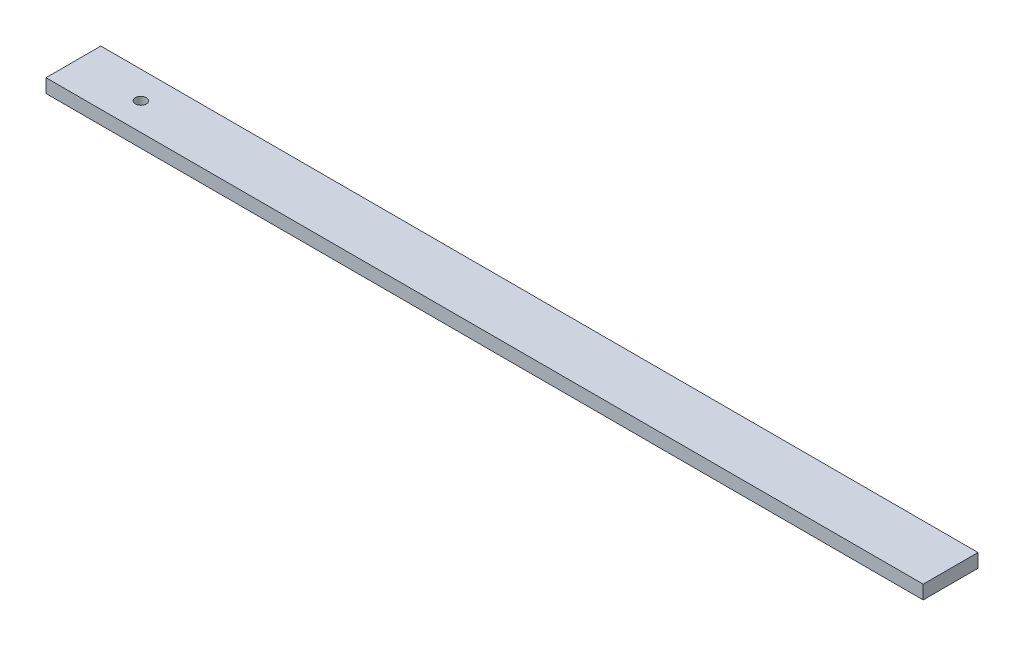
ISO-10303-21;
HEADER;
FILE_DESCRIPTION(('STEP AP214'),'2;1');
FILE_NAME('part.step','',(''),(''),'','','');
FILE_SCHEMA(('AUTOMOTIVE_DESIGN { 1 0 10303 214 1 1 1 1 }'));
ENDSEC;
DATA;
#1=APPLICATION_CONTEXT('core data for automotive mechanical design processes');
#2=APPLICATION_PROTOCOL_DEFINITION('international standard','automotive_design',2000,#1);
#3=PRODUCT_CONTEXT('',#1,'mechanical');
#4=PRODUCT('Part','Part','',(#3));
#5=PRODUCT_RELATED_PRODUCT_CATEGORY('part','',(#4));
#6=PRODUCT_DEFINITION_FORMATION('','',#4);
#7=PRODUCT_DEFINITION_CONTEXT('part definition',#1,'design');
#8=PRODUCT_DEFINITION('design','',#6,#7);
#9=PRODUCT_DEFINITION_SHAPE('','',#8);
#10=(LENGTH_UNIT() NAMED_UNIT(*) SI_UNIT(.MILLI.,.METRE.));
#11=(NAMED_UNIT(*) PLANE_ANGLE_UNIT() SI_UNIT($,.RADIAN.));
#12=(NAMED_UNIT(*) SI_UNIT($,.STERADIAN.) SOLID_ANGLE_UNIT());
#13=UNCERTAINTY_MEASURE_WITH_UNIT(LENGTH_MEASURE(1.E-05),#10,'distance_accuracy_value','');
#14=(GEOMETRIC_REPRESENTATION_CONTEXT(3) GLOBAL_UNCERTAINTY_ASSIGNED_CONTEXT((#13)) GLOBAL_UNIT_ASSIGNED_CONTEXT((#10,
#11,#12)) REPRESENTATION_CONTEXT('',''));
#15=CARTESIAN_POINT('',(0.,0.,0.));
#16=DIRECTION('',(0.,0.,1.));
#17=DIRECTION('',(1.,0.,0.));
#18=AXIS2_PLACEMENT_3D('',#15,#16,#17);
#19=CARTESIAN_POINT('',(211.2,-3.05,12.2));
#20=DIRECTION('',(0.,0.,-1.));
#21=DIRECTION('',(-1.,0.,0.));
#22=AXIS2_PLACEMENT_3D('',#19,#20,#21);
#23=PLANE('',#22);
#24=DIRECTION('',(0.,-1.,0.));
#25=VECTOR('',#24,1.);
#26=CARTESIAN_POINT('',(-195.2,-3.05,12.2));
#27=LINE('',#26,#25);
#28=CARTESIAN_POINT('',(-195.2,3.3,12.2));
#29=VERTEX_POINT('',#28);
#30=CARTESIAN_POINT('',(-195.2,-3.05,12.2));
#31=VERTEX_POINT('',#30);
#32=EDGE_CURVE('E99',#29,#31,#27,.T.);
#33=ORIENTED_EDGE('',*,*,#32,.T.);
#34=DIRECTION('',(-1.,0.,0.));
#35=VECTOR('',#34,1.);
#36=CARTESIAN_POINT('',(211.2,-3.05,12.2));
#37=LINE('',#36,#35);
#38=CARTESIAN_POINT('',(211.2,-3.05,12.2));
#39=VERTEX_POINT('',#38);
#40=EDGE_CURVE('E11',#39,#31,#37,.T.);
#41=ORIENTED_EDGE('',*,*,#40,.F.);
#42=DIRECTION('',(0.,-1.,0.));
#43=VECTOR('',#42,1.);
#44=CARTESIAN_POINT('',(211.2,-3.05,12.2));
#45=LINE('',#44,#43);
#46=CARTESIAN_POINT('',(211.2,3.3,12.2));
#47=VERTEX_POINT('',#46);
#48=EDGE_CURVE('E87',#47,#39,#45,.T.);
#49=ORIENTED_EDGE('',*,*,#48,.F.);
#50=DIRECTION('',(-1.,0.,0.));
#51=VECTOR('',#50,1.);
#52=CARTESIAN_POINT('',(211.2,3.3,12.2));
#53=LINE('',#52,#51);
#54=EDGE_CURVE('E95',#47,#29,#53,.T.);
#55=ORIENTED_EDGE('',*,*,#54,.T.);
#56=EDGE_LOOP('',(#33,#41,#49,#55));
#57=FACE_BOUND('',#56,.T.);
#58=ADVANCED_FACE('F36',(#57),#23,.F.);
#59=CARTESIAN_POINT('',(211.2,-3.05,12.2));
#60=DIRECTION('',(0.,1.,0.));
#61=DIRECTION('',(0.,0.,1.));
#62=AXIS2_PLACEMENT_3D('',#59,#60,#61);
#63=PLANE('',#62);
#64=CARTESIAN_POINT('',(-163.958,-3.05,-0.5));
#65=DIRECTION('',(0.,1.,0.));
#66=DIRECTION('',(0.,0.,1.));
#67=AXIS2_PLACEMENT_3D('',#64,#65,#66);
#68=CIRCLE('',#67,2.53999999999998);
#69=CARTESIAN_POINT('',(-163.958,-3.05,2.03999999999998));
#70=VERTEX_POINT('',#69);
#71=EDGE_CURVE('E102',#70,#70,#68,.T.);
#72=ORIENTED_EDGE('',*,*,#71,.T.);
#73=EDGE_LOOP('',(#72));
#74=FACE_BOUND('',#73,.T.);
#75=DIRECTION('',(0.,0.,-1.));
#76=VECTOR('',#75,1.);
#77=CARTESIAN_POINT('',(-195.2,-3.05,12.2));
#78=LINE('',#77,#76);
#79=CARTESIAN_POINT('',(-195.2,-3.05,-13.2));
#80=VERTEX_POINT('',#79);
#81=EDGE_CURVE('E91',#31,#80,#78,.T.);
#82=ORIENTED_EDGE('',*,*,#81,.T.);
#83=DIRECTION('',(-1.,0.,0.));
#84=VECTOR('',#83,1.);
#85=CARTESIAN_POINT('',(211.2,-3.05,-13.2));
#86=LINE('',#85,#84);
#87=CARTESIAN_POINT('',(211.2,-3.05,-13.2));
#88=VERTEX_POINT('',#87);
#89=EDGE_CURVE('E44',#88,#80,#86,.T.);
#90=ORIENTED_EDGE('',*,*,#89,.F.);
#91=DIRECTION('',(0.,0.,-1.));
#92=VECTOR('',#91,1.);
#93=CARTESIAN_POINT('',(211.2,-3.05,12.2));
#94=LINE('',#93,#92);
#95=EDGE_CURVE('E82',#39,#88,#94,.T.);
#96=ORIENTED_EDGE('',*,*,#95,.F.);
#97=ORIENTED_EDGE('',*,*,#40,.T.);
#98=EDGE_LOOP('',(#82,#90,#96,#97));
#99=FACE_BOUND('',#98,.T.);
#100=ADVANCED_FACE('F90',(#74,#99),#63,.F.);
#101=CARTESIAN_POINT('',(211.2,-3.05,-13.2));
#102=DIRECTION('',(0.,0.,1.));
#103=DIRECTION('',(1.,0.,0.));
#104=AXIS2_PLACEMENT_3D('',#101,#102,#103);
#105=PLANE('',#104);
#106=DIRECTION('',(0.,1.,0.));
#107=VECTOR('',#106,1.);
#108=CARTESIAN_POINT('',(-195.2,-3.05,-13.2));
#109=LINE('',#108,#107);
#110=CARTESIAN_POINT('',(-195.2,3.3,-13.2));
#111=VERTEX_POINT('',#110);
#112=EDGE_CURVE('E69',#80,#111,#109,.T.);
#113=ORIENTED_EDGE('',*,*,#112,.T.);
#114=DIRECTION('',(-1.,0.,0.));
#115=VECTOR('',#114,1.);
#116=CARTESIAN_POINT('',(211.2,3.3,-13.2));
#117=LINE('',#116,#115);
#118=CARTESIAN_POINT('',(211.2,3.3,-13.2));
#119=VERTEX_POINT('',#118);
#120=EDGE_CURVE('E92',#119,#111,#117,.T.);
#121=ORIENTED_EDGE('',*,*,#120,.F.);
#122=DIRECTION('',(0.,1.,0.));
#123=VECTOR('',#122,1.);
#124=CARTESIAN_POINT('',(211.2,-3.05,-13.2));
#125=LINE('',#124,#123);
#126=EDGE_CURVE('E85',#88,#119,#125,.T.);
#127=ORIENTED_EDGE('',*,*,#126,.F.);
#128=ORIENTED_EDGE('',*,*,#89,.T.);
#129=EDGE_LOOP('',(#113,#121,#127,#128));
#130=FACE_BOUND('',#129,.T.);
#131=ADVANCED_FACE('F93',(#130),#105,.F.);
#132=CARTESIAN_POINT('',(211.2,3.3,12.2));
#133=DIRECTION('',(0.,-1.,0.));
#134=DIRECTION('',(0.,0.,-1.));
#135=AXIS2_PLACEMENT_3D('',#132,#133,#134);
#136=PLANE('',#135);
#137=CARTESIAN_POINT('',(-163.958,3.3,-0.5));
#138=DIRECTION('',(0.,1.,0.));
#139=DIRECTION('',(0.,0.,1.));
#140=AXIS2_PLACEMENT_3D('',#137,#138,#139);
#141=CIRCLE('',#140,2.53999999999998);
#142=CARTESIAN_POINT('',(-163.958,3.3,2.03999999999998));
#143=VERTEX_POINT('',#142);
#144=EDGE_CURVE('E113',#143,#143,#141,.T.);
#145=ORIENTED_EDGE('',*,*,#144,.F.);
#146=EDGE_LOOP('',(#145));
#147=FACE_BOUND('',#146,.T.);
#148=DIRECTION('',(0.,0.,1.));
#149=VECTOR('',#148,1.);
#150=CARTESIAN_POINT('',(-195.2,3.3,12.2));
#151=LINE('',#150,#149);
#152=EDGE_CURVE('E75',#111,#29,#151,.T.);
#153=ORIENTED_EDGE('',*,*,#152,.T.);
#154=ORIENTED_EDGE('',*,*,#54,.F.);
#155=DIRECTION('',(0.,0.,1.));
#156=VECTOR('',#155,1.);
#157=CARTESIAN_POINT('',(211.2,3.3,12.2));
#158=LINE('',#157,#156);
#159=EDGE_CURVE('E52',#119,#47,#158,.T.);
#160=ORIENTED_EDGE('',*,*,#159,.F.);
#161=ORIENTED_EDGE('',*,*,#120,.T.);
#162=EDGE_LOOP('',(#153,#154,#160,#161));
#163=FACE_BOUND('',#162,.T.);
#164=ADVANCED_FACE('F107',(#147,#163),#136,.F.);
#165=CARTESIAN_POINT('',(211.2,-3.05,12.2));
#166=DIRECTION('',(-1.,0.,0.));
#167=DIRECTION('',(0.,0.,1.));
#168=AXIS2_PLACEMENT_3D('',#165,#166,#167);
#169=PLANE('',#168);
#170=ORIENTED_EDGE('',*,*,#48,.T.);
#171=ORIENTED_EDGE('',*,*,#95,.T.);
#172=ORIENTED_EDGE('',*,*,#126,.T.);
#173=ORIENTED_EDGE('',*,*,#159,.T.);
#174=EDGE_LOOP('',(#170,#171,#172,#173));
#175=FACE_BOUND('',#174,.T.);
#176=ADVANCED_FACE('F83',(#175),#169,.F.);
#177=CARTESIAN_POINT('',(-195.2,-3.05,12.2));
#178=DIRECTION('',(-1.,0.,0.));
#179=DIRECTION('',(0.,0.,1.));
#180=AXIS2_PLACEMENT_3D('',#177,#178,#179);
#181=PLANE('',#180);
#182=ORIENTED_EDGE('',*,*,#32,.F.);
#183=ORIENTED_EDGE('',*,*,#152,.F.);
#184=ORIENTED_EDGE('',*,*,#112,.F.);
#185=ORIENTED_EDGE('',*,*,#81,.F.);
#186=EDGE_LOOP('',(#182,#183,#184,#185));
#187=FACE_BOUND('',#186,.T.);
#188=ADVANCED_FACE('F110',(#187),#181,.T.);
#189=CARTESIAN_POINT('',(-163.958,-3.05,-0.5));
#190=DIRECTION('',(0.,1.,0.));
#191=DIRECTION('',(0.,0.,1.));
#192=AXIS2_PLACEMENT_3D('',#189,#190,#191);
#193=CYLINDRICAL_SURFACE('',#192,2.53999999999998);
#194=ORIENTED_EDGE('',*,*,#71,.F.);
#195=EDGE_LOOP('',(#194));
#196=FACE_BOUND('',#195,.T.);
#197=ORIENTED_EDGE('',*,*,#144,.T.);
#198=EDGE_LOOP('',(#197));
#199=FACE_BOUND('',#198,.T.);
#200=ADVANCED_FACE('F120',(#196,#199),#193,.F.);
#201=CLOSED_SHELL('',(#58,#100,#131,#164,#176,#188,#200));
#202=MANIFOLD_SOLID_BREP('B2',#201);
#203=ADVANCED_BREP_SHAPE_REPRESENTATION('',(#18,#202),#14);
#204=SHAPE_DEFINITION_REPRESENTATION(#9,#203);
ENDSEC;
END-ISO-10303-21;
